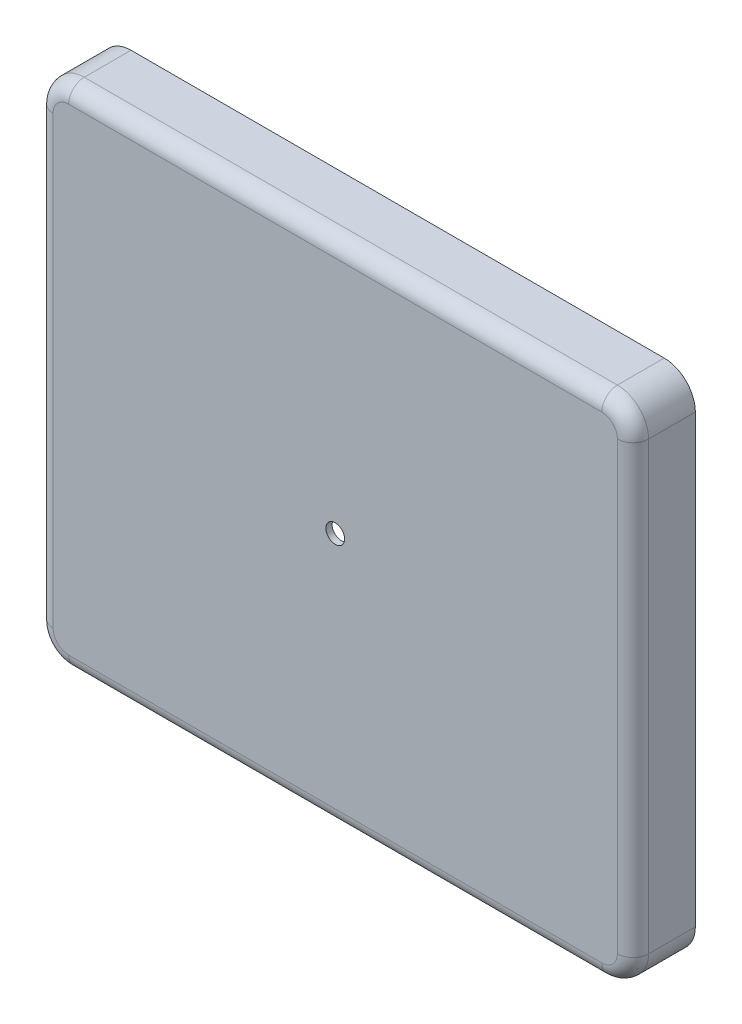
ISO-10303-21;
HEADER;
FILE_DESCRIPTION(('STEP AP214'),'2;1');
FILE_NAME('part.step','',(''),(''),'','','');
FILE_SCHEMA(('AUTOMOTIVE_DESIGN { 1 0 10303 214 1 1 1 1 }'));
ENDSEC;
DATA;
#1=APPLICATION_CONTEXT('core data for automotive mechanical design processes');
#2=APPLICATION_PROTOCOL_DEFINITION('international standard','automotive_design',2000,#1);
#3=PRODUCT_CONTEXT('',#1,'mechanical');
#4=PRODUCT('Part','Part','',(#3));
#5=PRODUCT_RELATED_PRODUCT_CATEGORY('part','',(#4));
#6=PRODUCT_DEFINITION_FORMATION('','',#4);
#7=PRODUCT_DEFINITION_CONTEXT('part definition',#1,'design');
#8=PRODUCT_DEFINITION('design','',#6,#7);
#9=PRODUCT_DEFINITION_SHAPE('','',#8);
#10=(LENGTH_UNIT() NAMED_UNIT(*) SI_UNIT(.MILLI.,.METRE.));
#11=(NAMED_UNIT(*) PLANE_ANGLE_UNIT() SI_UNIT($,.RADIAN.));
#12=(NAMED_UNIT(*) SI_UNIT($,.STERADIAN.) SOLID_ANGLE_UNIT());
#13=UNCERTAINTY_MEASURE_WITH_UNIT(LENGTH_MEASURE(1.E-05),#10,'distance_accuracy_value','');
#14=(GEOMETRIC_REPRESENTATION_CONTEXT(3) GLOBAL_UNCERTAINTY_ASSIGNED_CONTEXT((#13)) GLOBAL_UNIT_ASSIGNED_CONTEXT((#10,
#11,#12)) REPRESENTATION_CONTEXT('',''));
#15=CARTESIAN_POINT('',(0.,0.,0.));
#16=DIRECTION('',(0.,0.,1.));
#17=DIRECTION('',(1.,0.,0.));
#18=AXIS2_PLACEMENT_3D('',#15,#16,#17);
#19=CARTESIAN_POINT('',(0.,0.,0.));
#20=DIRECTION('',(0.,0.,1.));
#21=DIRECTION('',(1.,0.,0.));
#22=AXIS2_PLACEMENT_3D('',#19,#20,#21);
#23=PLANE('',#22);
#24=DIRECTION('',(1.,0.,0.));
#25=VECTOR('',#24,1.);
#26=CARTESIAN_POINT('',(-95.5,-81.5,0.));
#27=LINE('',#26,#25);
#28=CARTESIAN_POINT('',(-85.5,-81.5,0.));
#29=VERTEX_POINT('',#28);
#30=CARTESIAN_POINT('',(85.5,-81.5,0.));
#31=VERTEX_POINT('',#30);
#32=EDGE_CURVE('E336',#29,#31,#27,.T.);
#33=ORIENTED_EDGE('',*,*,#32,.F.);
#34=CARTESIAN_POINT('',(-85.5,-71.5,0.));
#35=DIRECTION('',(0.,0.,1.));
#36=DIRECTION('',(1.,0.,0.));
#37=AXIS2_PLACEMENT_3D('',#34,#35,#36);
#38=CIRCLE('',#37,10.);
#39=CARTESIAN_POINT('',(-95.5,-71.5,0.));
#40=VERTEX_POINT('',#39);
#41=EDGE_CURVE('E356',#29,#40,#38,.F.);
#42=ORIENTED_EDGE('',*,*,#41,.T.);
#43=DIRECTION('',(0.,-1.,0.));
#44=VECTOR('',#43,1.);
#45=CARTESIAN_POINT('',(-95.5,81.5,0.));
#46=LINE('',#45,#44);
#47=CARTESIAN_POINT('',(-95.5,71.5,0.));
#48=VERTEX_POINT('',#47);
#49=EDGE_CURVE('E332',#48,#40,#46,.T.);
#50=ORIENTED_EDGE('',*,*,#49,.F.);
#51=CARTESIAN_POINT('',(-85.5,71.5,0.));
#52=DIRECTION('',(0.,0.,1.));
#53=DIRECTION('',(1.,0.,0.));
#54=AXIS2_PLACEMENT_3D('',#51,#52,#53);
#55=CIRCLE('',#54,10.);
#56=CARTESIAN_POINT('',(-85.5,81.5,0.));
#57=VERTEX_POINT('',#56);
#58=EDGE_CURVE('E347',#48,#57,#55,.F.);
#59=ORIENTED_EDGE('',*,*,#58,.T.);
#60=DIRECTION('',(-1.,0.,0.));
#61=VECTOR('',#60,1.);
#62=CARTESIAN_POINT('',(-95.5,81.5,0.));
#63=LINE('',#62,#61);
#64=CARTESIAN_POINT('',(85.5,81.5,0.));
#65=VERTEX_POINT('',#64);
#66=EDGE_CURVE('E328',#65,#57,#63,.T.);
#67=ORIENTED_EDGE('',*,*,#66,.F.);
#68=CARTESIAN_POINT('',(85.5,71.5,0.));
#69=DIRECTION('',(0.,0.,1.));
#70=DIRECTION('',(1.,0.,0.));
#71=AXIS2_PLACEMENT_3D('',#68,#69,#70);
#72=CIRCLE('',#71,10.);
#73=CARTESIAN_POINT('',(95.5,71.5,0.));
#74=VERTEX_POINT('',#73);
#75=EDGE_CURVE('E350',#65,#74,#72,.F.);
#76=ORIENTED_EDGE('',*,*,#75,.T.);
#77=DIRECTION('',(0.,1.,0.));
#78=VECTOR('',#77,1.);
#79=CARTESIAN_POINT('',(95.5,81.5,0.));
#80=LINE('',#79,#78);
#81=CARTESIAN_POINT('',(95.5,-71.5,0.));
#82=VERTEX_POINT('',#81);
#83=EDGE_CURVE('E324',#82,#74,#80,.T.);
#84=ORIENTED_EDGE('',*,*,#83,.F.);
#85=CARTESIAN_POINT('',(85.5,-71.5,0.));
#86=DIRECTION('',(0.,0.,1.));
#87=DIRECTION('',(1.,0.,0.));
#88=AXIS2_PLACEMENT_3D('',#85,#86,#87);
#89=CIRCLE('',#88,10.);
#90=EDGE_CURVE('E353',#82,#31,#89,.F.);
#91=ORIENTED_EDGE('',*,*,#90,.T.);
#92=EDGE_LOOP('',(#33,#42,#50,#59,#67,#76,#84,#91));
#93=FACE_BOUND('',#92,.T.);
#94=CARTESIAN_POINT('',(-85.5,-71.5,0.));
#95=DIRECTION('',(0.,0.,1.));
#96=DIRECTION('',(1.,0.,0.));
#97=AXIS2_PLACEMENT_3D('',#94,#95,#96);
#98=CIRCLE('',#97,8.);
#99=CARTESIAN_POINT('',(-85.5,-79.5,0.));
#100=VERTEX_POINT('',#99);
#101=CARTESIAN_POINT('',(-93.5,-71.5,0.));
#102=VERTEX_POINT('',#101);
#103=EDGE_CURVE('E302',#100,#102,#98,.F.);
#104=ORIENTED_EDGE('',*,*,#103,.F.);
#105=DIRECTION('',(1.,0.,0.));
#106=VECTOR('',#105,1.);
#107=CARTESIAN_POINT('',(-95.5,-79.5,0.));
#108=LINE('',#107,#106);
#109=CARTESIAN_POINT('',(85.5,-79.5,0.));
#110=VERTEX_POINT('',#109);
#111=EDGE_CURVE('E304',#100,#110,#108,.T.);
#112=ORIENTED_EDGE('',*,*,#111,.T.);
#113=CARTESIAN_POINT('',(85.5,-71.5,0.));
#114=DIRECTION('',(0.,0.,1.));
#115=DIRECTION('',(1.,0.,0.));
#116=AXIS2_PLACEMENT_3D('',#113,#114,#115);
#117=CIRCLE('',#116,8.);
#118=CARTESIAN_POINT('',(93.5,-71.5,0.));
#119=VERTEX_POINT('',#118);
#120=EDGE_CURVE('E299',#119,#110,#117,.F.);
#121=ORIENTED_EDGE('',*,*,#120,.F.);
#122=DIRECTION('',(0.,1.,0.));
#123=VECTOR('',#122,1.);
#124=CARTESIAN_POINT('',(93.5,81.5,0.));
#125=LINE('',#124,#123);
#126=CARTESIAN_POINT('',(93.5,71.5,0.));
#127=VERTEX_POINT('',#126);
#128=EDGE_CURVE('E59',#119,#127,#125,.T.);
#129=ORIENTED_EDGE('',*,*,#128,.T.);
#130=CARTESIAN_POINT('',(85.5,71.5,0.));
#131=DIRECTION('',(0.,0.,1.));
#132=DIRECTION('',(1.,0.,0.));
#133=AXIS2_PLACEMENT_3D('',#130,#131,#132);
#134=CIRCLE('',#133,8.);
#135=CARTESIAN_POINT('',(85.5,79.5,0.));
#136=VERTEX_POINT('',#135);
#137=EDGE_CURVE('E303',#136,#127,#134,.F.);
#138=ORIENTED_EDGE('',*,*,#137,.F.);
#139=DIRECTION('',(-1.,0.,0.));
#140=VECTOR('',#139,1.);
#141=CARTESIAN_POINT('',(-95.5,79.5,0.));
#142=LINE('',#141,#140);
#143=CARTESIAN_POINT('',(-85.5,79.5,0.));
#144=VERTEX_POINT('',#143);
#145=EDGE_CURVE('E246',#136,#144,#142,.T.);
#146=ORIENTED_EDGE('',*,*,#145,.T.);
#147=CARTESIAN_POINT('',(-85.5,71.5,0.));
#148=DIRECTION('',(0.,0.,1.));
#149=DIRECTION('',(1.,0.,0.));
#150=AXIS2_PLACEMENT_3D('',#147,#148,#149);
#151=CIRCLE('',#150,8.);
#152=CARTESIAN_POINT('',(-93.5,71.5,0.));
#153=VERTEX_POINT('',#152);
#154=EDGE_CURVE('E315',#153,#144,#151,.F.);
#155=ORIENTED_EDGE('',*,*,#154,.F.);
#156=DIRECTION('',(0.,-1.,0.));
#157=VECTOR('',#156,1.);
#158=CARTESIAN_POINT('',(-93.5,81.5,0.));
#159=LINE('',#158,#157);
#160=EDGE_CURVE('E308',#153,#102,#159,.T.);
#161=ORIENTED_EDGE('',*,*,#160,.T.);
#162=EDGE_LOOP('',(#104,#112,#121,#129,#138,#146,#155,#161));
#163=FACE_BOUND('',#162,.T.);
#164=ADVANCED_FACE('F41',(#93,#163),#23,.F.);
#165=CARTESIAN_POINT('',(95.5,81.5,20.));
#166=DIRECTION('',(-1.,0.,0.));
#167=DIRECTION('',(0.,0.,1.));
#168=AXIS2_PLACEMENT_3D('',#165,#166,#167);
#169=PLANE('',#168);
#170=DIRECTION('',(0.,0.,-1.));
#171=VECTOR('',#170,1.);
#172=CARTESIAN_POINT('',(95.5,71.5,20.));
#173=LINE('',#172,#171);
#174=CARTESIAN_POINT('',(95.5,71.5,15.));
#175=VERTEX_POINT('',#174);
#176=EDGE_CURVE('E365',#74,#175,#173,.F.);
#177=ORIENTED_EDGE('',*,*,#176,.T.);
#178=DIRECTION('',(0.,1.,0.));
#179=VECTOR('',#178,1.);
#180=CARTESIAN_POINT('',(95.5,-71.5,15.));
#181=LINE('',#180,#179);
#182=CARTESIAN_POINT('',(95.5,-71.5,15.));
#183=VERTEX_POINT('',#182);
#184=EDGE_CURVE('E414',#175,#183,#181,.F.);
#185=ORIENTED_EDGE('',*,*,#184,.T.);
#186=DIRECTION('',(0.,0.,-1.));
#187=VECTOR('',#186,1.);
#188=CARTESIAN_POINT('',(95.5,-71.5,20.));
#189=LINE('',#188,#187);
#190=EDGE_CURVE('E369',#183,#82,#189,.T.);
#191=ORIENTED_EDGE('',*,*,#190,.T.);
#192=ORIENTED_EDGE('',*,*,#83,.T.);
#193=EDGE_LOOP('',(#177,#185,#191,#192));
#194=FACE_BOUND('',#193,.T.);
#195=ADVANCED_FACE('F482',(#194),#169,.F.);
#196=CARTESIAN_POINT('',(-95.5,81.5,20.));
#197=DIRECTION('',(0.,-1.,0.));
#198=DIRECTION('',(0.,0.,-1.));
#199=AXIS2_PLACEMENT_3D('',#196,#197,#198);
#200=PLANE('',#199);
#201=DIRECTION('',(0.,0.,-1.));
#202=VECTOR('',#201,1.);
#203=CARTESIAN_POINT('',(-85.5,81.5,20.));
#204=LINE('',#203,#202);
#205=CARTESIAN_POINT('',(-85.5,81.5,15.));
#206=VERTEX_POINT('',#205);
#207=EDGE_CURVE('E372',#57,#206,#204,.F.);
#208=ORIENTED_EDGE('',*,*,#207,.T.);
#209=DIRECTION('',(-1.,0.,0.));
#210=VECTOR('',#209,1.);
#211=CARTESIAN_POINT('',(85.5,81.5,15.));
#212=LINE('',#211,#210);
#213=CARTESIAN_POINT('',(85.5,81.5,15.));
#214=VERTEX_POINT('',#213);
#215=EDGE_CURVE('E408',#206,#214,#212,.F.);
#216=ORIENTED_EDGE('',*,*,#215,.T.);
#217=DIRECTION('',(0.,0.,-1.));
#218=VECTOR('',#217,1.);
#219=CARTESIAN_POINT('',(85.5,81.5,20.));
#220=LINE('',#219,#218);
#221=EDGE_CURVE('E376',#214,#65,#220,.T.);
#222=ORIENTED_EDGE('',*,*,#221,.T.);
#223=ORIENTED_EDGE('',*,*,#66,.T.);
#224=EDGE_LOOP('',(#208,#216,#222,#223));
#225=FACE_BOUND('',#224,.T.);
#226=ADVANCED_FACE('F535',(#225),#200,.F.);
#227=CARTESIAN_POINT('',(-95.5,81.5,20.));
#228=DIRECTION('',(1.,0.,0.));
#229=DIRECTION('',(0.,1.,0.));
#230=AXIS2_PLACEMENT_3D('',#227,#228,#229);
#231=PLANE('',#230);
#232=DIRECTION('',(0.,0.,-1.));
#233=VECTOR('',#232,1.);
#234=CARTESIAN_POINT('',(-95.5,-71.5,20.));
#235=LINE('',#234,#233);
#236=CARTESIAN_POINT('',(-95.5,-71.5,15.));
#237=VERTEX_POINT('',#236);
#238=EDGE_CURVE('E362',#40,#237,#235,.F.);
#239=ORIENTED_EDGE('',*,*,#238,.T.);
#240=DIRECTION('',(0.,-1.,0.));
#241=VECTOR('',#240,1.);
#242=CARTESIAN_POINT('',(-95.5,71.5,15.));
#243=LINE('',#242,#241);
#244=CARTESIAN_POINT('',(-95.5,71.5,15.));
#245=VERTEX_POINT('',#244);
#246=EDGE_CURVE('E11',#237,#245,#243,.F.);
#247=ORIENTED_EDGE('',*,*,#246,.T.);
#248=DIRECTION('',(0.,0.,-1.));
#249=VECTOR('',#248,1.);
#250=CARTESIAN_POINT('',(-95.5,71.5,20.));
#251=LINE('',#250,#249);
#252=EDGE_CURVE('E359',#245,#48,#251,.T.);
#253=ORIENTED_EDGE('',*,*,#252,.T.);
#254=ORIENTED_EDGE('',*,*,#49,.T.);
#255=EDGE_LOOP('',(#239,#247,#253,#254));
#256=FACE_BOUND('',#255,.T.);
#257=ADVANCED_FACE('F512',(#256),#231,.F.);
#258=CARTESIAN_POINT('',(-95.5,-81.5,20.));
#259=DIRECTION('',(0.,1.,0.));
#260=DIRECTION('',(0.,0.,1.));
#261=AXIS2_PLACEMENT_3D('',#258,#259,#260);
#262=PLANE('',#261);
#263=DIRECTION('',(0.,0.,-1.));
#264=VECTOR('',#263,1.);
#265=CARTESIAN_POINT('',(85.5,-81.5,20.));
#266=LINE('',#265,#264);
#267=CARTESIAN_POINT('',(85.5,-81.5,15.));
#268=VERTEX_POINT('',#267);
#269=EDGE_CURVE('E340',#31,#268,#266,.F.);
#270=ORIENTED_EDGE('',*,*,#269,.T.);
#271=DIRECTION('',(1.,0.,0.));
#272=VECTOR('',#271,1.);
#273=CARTESIAN_POINT('',(-85.5,-81.5,15.));
#274=LINE('',#273,#272);
#275=CARTESIAN_POINT('',(-85.5,-81.5,15.));
#276=VERTEX_POINT('',#275);
#277=EDGE_CURVE('E420',#268,#276,#274,.F.);
#278=ORIENTED_EDGE('',*,*,#277,.T.);
#279=DIRECTION('',(0.,0.,-1.));
#280=VECTOR('',#279,1.);
#281=CARTESIAN_POINT('',(-85.5,-81.5,20.));
#282=LINE('',#281,#280);
#283=EDGE_CURVE('E344',#276,#29,#282,.T.);
#284=ORIENTED_EDGE('',*,*,#283,.T.);
#285=ORIENTED_EDGE('',*,*,#32,.T.);
#286=EDGE_LOOP('',(#270,#278,#284,#285));
#287=FACE_BOUND('',#286,.T.);
#288=ADVANCED_FACE('F471',(#287),#262,.F.);
#289=CARTESIAN_POINT('',(0.,0.,20.));
#290=DIRECTION('',(0.,0.,1.));
#291=DIRECTION('',(1.,0.,0.));
#292=AXIS2_PLACEMENT_3D('',#289,#290,#291);
#293=PLANE('',#292);
#294=CARTESIAN_POINT('',(0.,0.,20.));
#295=DIRECTION('',(0.,0.,1.));
#296=DIRECTION('',(1.,0.,0.));
#297=AXIS2_PLACEMENT_3D('',#294,#295,#296);
#298=CIRCLE('',#297,3.);
#299=CARTESIAN_POINT('',(3.,0.,20.));
#300=VERTEX_POINT('',#299);
#301=EDGE_CURVE('E293',#300,#300,#298,.T.);
#302=ORIENTED_EDGE('',*,*,#301,.F.);
#303=EDGE_LOOP('',(#302));
#304=FACE_BOUND('',#303,.T.);
#305=DIRECTION('',(-1.,0.,0.));
#306=VECTOR('',#305,1.);
#307=CARTESIAN_POINT('',(-85.5,76.5,20.));
#308=LINE('',#307,#306);
#309=CARTESIAN_POINT('',(85.5,76.5,20.));
#310=VERTEX_POINT('',#309);
#311=CARTESIAN_POINT('',(-85.5,76.5,20.));
#312=VERTEX_POINT('',#311);
#313=EDGE_CURVE('E397',#310,#312,#308,.T.);
#314=ORIENTED_EDGE('',*,*,#313,.T.);
#315=CARTESIAN_POINT('',(-85.5,71.5,20.));
#316=DIRECTION('',(0.,0.,1.));
#317=DIRECTION('',(1.,0.,0.));
#318=AXIS2_PLACEMENT_3D('',#315,#316,#317);
#319=CIRCLE('',#318,5.);
#320=CARTESIAN_POINT('',(-90.5,71.5,20.));
#321=VERTEX_POINT('',#320);
#322=EDGE_CURVE('E400',#312,#321,#319,.T.);
#323=ORIENTED_EDGE('',*,*,#322,.T.);
#324=DIRECTION('',(0.,-1.,0.));
#325=VECTOR('',#324,1.);
#326=CARTESIAN_POINT('',(-90.5,-71.5,20.));
#327=LINE('',#326,#325);
#328=CARTESIAN_POINT('',(-90.5,-71.5,20.));
#329=VERTEX_POINT('',#328);
#330=EDGE_CURVE('E379',#321,#329,#327,.T.);
#331=ORIENTED_EDGE('',*,*,#330,.T.);
#332=CARTESIAN_POINT('',(-85.5,-71.5,20.));
#333=DIRECTION('',(0.,0.,1.));
#334=DIRECTION('',(1.,0.,0.));
#335=AXIS2_PLACEMENT_3D('',#332,#333,#334);
#336=CIRCLE('',#335,5.);
#337=CARTESIAN_POINT('',(-85.5,-76.5,20.));
#338=VERTEX_POINT('',#337);
#339=EDGE_CURVE('E382',#329,#338,#336,.T.);
#340=ORIENTED_EDGE('',*,*,#339,.T.);
#341=DIRECTION('',(1.,0.,0.));
#342=VECTOR('',#341,1.);
#343=CARTESIAN_POINT('',(85.5,-76.5,20.));
#344=LINE('',#343,#342);
#345=CARTESIAN_POINT('',(85.5,-76.5,20.));
#346=VERTEX_POINT('',#345);
#347=EDGE_CURVE('E385',#338,#346,#344,.T.);
#348=ORIENTED_EDGE('',*,*,#347,.T.);
#349=CARTESIAN_POINT('',(85.5,-71.5,20.));
#350=DIRECTION('',(0.,0.,1.));
#351=DIRECTION('',(1.,0.,0.));
#352=AXIS2_PLACEMENT_3D('',#349,#350,#351);
#353=CIRCLE('',#352,5.);
#354=CARTESIAN_POINT('',(90.5,-71.5,20.));
#355=VERTEX_POINT('',#354);
#356=EDGE_CURVE('E388',#346,#355,#353,.T.);
#357=ORIENTED_EDGE('',*,*,#356,.T.);
#358=DIRECTION('',(0.,1.,0.));
#359=VECTOR('',#358,1.);
#360=CARTESIAN_POINT('',(90.5,71.5,20.));
#361=LINE('',#360,#359);
#362=CARTESIAN_POINT('',(90.5,71.5,20.));
#363=VERTEX_POINT('',#362);
#364=EDGE_CURVE('E391',#355,#363,#361,.T.);
#365=ORIENTED_EDGE('',*,*,#364,.T.);
#366=CARTESIAN_POINT('',(85.5,71.5,20.));
#367=DIRECTION('',(0.,0.,1.));
#368=DIRECTION('',(1.,0.,0.));
#369=AXIS2_PLACEMENT_3D('',#366,#367,#368);
#370=CIRCLE('',#369,5.);
#371=EDGE_CURVE('E394',#363,#310,#370,.T.);
#372=ORIENTED_EDGE('',*,*,#371,.T.);
#373=EDGE_LOOP('',(#314,#323,#331,#340,#348,#357,#365,#372));
#374=FACE_BOUND('',#373,.T.);
#375=ADVANCED_FACE('F498',(#304,#374),#293,.T.);
#376=CARTESIAN_POINT('',(-85.5,-71.5,20.));
#377=DIRECTION('',(0.,0.,-1.));
#378=DIRECTION('',(-1.,0.,0.));
#379=AXIS2_PLACEMENT_3D('',#376,#377,#378);
#380=CYLINDRICAL_SURFACE('',#379,10.);
#381=ORIENTED_EDGE('',*,*,#283,.F.);
#382=CARTESIAN_POINT('',(-85.5,-71.5,15.));
#383=DIRECTION('',(0.,0.,1.));
#384=DIRECTION('',(1.,0.,0.));
#385=AXIS2_PLACEMENT_3D('',#382,#383,#384);
#386=CIRCLE('',#385,10.);
#387=EDGE_CURVE('E51',#276,#237,#386,.F.);
#388=ORIENTED_EDGE('',*,*,#387,.T.);
#389=ORIENTED_EDGE('',*,*,#238,.F.);
#390=ORIENTED_EDGE('',*,*,#41,.F.);
#391=EDGE_LOOP('',(#381,#388,#389,#390));
#392=FACE_BOUND('',#391,.T.);
#393=ADVANCED_FACE('F547',(#392),#380,.T.);
#394=CARTESIAN_POINT('',(85.5,-71.5,20.));
#395=DIRECTION('',(0.,0.,-1.));
#396=DIRECTION('',(-1.,0.,0.));
#397=AXIS2_PLACEMENT_3D('',#394,#395,#396);
#398=CYLINDRICAL_SURFACE('',#397,10.);
#399=ORIENTED_EDGE('',*,*,#190,.F.);
#400=CARTESIAN_POINT('',(85.5,-71.5,15.));
#401=DIRECTION('',(0.,0.,1.));
#402=DIRECTION('',(1.,0.,0.));
#403=AXIS2_PLACEMENT_3D('',#400,#401,#402);
#404=CIRCLE('',#403,10.);
#405=EDGE_CURVE('E417',#183,#268,#404,.F.);
#406=ORIENTED_EDGE('',*,*,#405,.T.);
#407=ORIENTED_EDGE('',*,*,#269,.F.);
#408=ORIENTED_EDGE('',*,*,#90,.F.);
#409=EDGE_LOOP('',(#399,#406,#407,#408));
#410=FACE_BOUND('',#409,.T.);
#411=ADVANCED_FACE('F468',(#410),#398,.T.);
#412=CARTESIAN_POINT('',(85.5,71.5,20.));
#413=DIRECTION('',(0.,0.,-1.));
#414=DIRECTION('',(-1.,0.,0.));
#415=AXIS2_PLACEMENT_3D('',#412,#413,#414);
#416=CYLINDRICAL_SURFACE('',#415,10.);
#417=ORIENTED_EDGE('',*,*,#221,.F.);
#418=CARTESIAN_POINT('',(85.5,71.5,15.));
#419=DIRECTION('',(0.,0.,1.));
#420=DIRECTION('',(1.,0.,0.));
#421=AXIS2_PLACEMENT_3D('',#418,#419,#420);
#422=CIRCLE('',#421,10.);
#423=EDGE_CURVE('E411',#214,#175,#422,.F.);
#424=ORIENTED_EDGE('',*,*,#423,.T.);
#425=ORIENTED_EDGE('',*,*,#176,.F.);
#426=ORIENTED_EDGE('',*,*,#75,.F.);
#427=EDGE_LOOP('',(#417,#424,#425,#426));
#428=FACE_BOUND('',#427,.T.);
#429=ADVANCED_FACE('F485',(#428),#416,.T.);
#430=CARTESIAN_POINT('',(-85.5,71.5,20.));
#431=DIRECTION('',(0.,0.,-1.));
#432=DIRECTION('',(-1.,0.,0.));
#433=AXIS2_PLACEMENT_3D('',#430,#431,#432);
#434=CYLINDRICAL_SURFACE('',#433,10.);
#435=ORIENTED_EDGE('',*,*,#252,.F.);
#436=CARTESIAN_POINT('',(-85.5,71.5,15.));
#437=DIRECTION('',(0.,0.,1.));
#438=DIRECTION('',(1.,0.,0.));
#439=AXIS2_PLACEMENT_3D('',#436,#437,#438);
#440=CIRCLE('',#439,10.);
#441=EDGE_CURVE('E404',#245,#206,#440,.F.);
#442=ORIENTED_EDGE('',*,*,#441,.T.);
#443=ORIENTED_EDGE('',*,*,#207,.F.);
#444=ORIENTED_EDGE('',*,*,#58,.F.);
#445=EDGE_LOOP('',(#435,#442,#443,#444));
#446=FACE_BOUND('',#445,.T.);
#447=ADVANCED_FACE('F516',(#446),#434,.T.);
#448=CARTESIAN_POINT('',(85.5,-71.5,15.));
#449=DIRECTION('',(0.,0.,1.));
#450=DIRECTION('',(1.,0.,0.));
#451=AXIS2_PLACEMENT_3D('',#448,#449,#450);
#452=DEGENERATE_TOROIDAL_SURFACE('',#451,5.,5.,.T.);
#453=CARTESIAN_POINT('',(85.5,-76.5,15.));
#454=DIRECTION('',(-1.,0.,0.));
#455=DIRECTION('',(0.,-1.,0.));
#456=AXIS2_PLACEMENT_3D('',#453,#454,#455);
#457=CIRCLE('',#456,5.);
#458=EDGE_CURVE('E447',#268,#346,#457,.T.);
#459=ORIENTED_EDGE('',*,*,#458,.F.);
#460=ORIENTED_EDGE('',*,*,#405,.F.);
#461=CARTESIAN_POINT('',(90.5,-71.5,15.));
#462=DIRECTION('',(0.,1.,0.));
#463=DIRECTION('',(0.,0.,1.));
#464=AXIS2_PLACEMENT_3D('',#461,#462,#463);
#465=CIRCLE('',#464,5.);
#466=EDGE_CURVE('E45',#355,#183,#465,.T.);
#467=ORIENTED_EDGE('',*,*,#466,.F.);
#468=ORIENTED_EDGE('',*,*,#356,.F.);
#469=EDGE_LOOP('',(#459,#460,#467,#468));
#470=FACE_BOUND('',#469,.T.);
#471=ADVANCED_FACE('F43',(#470),#452,.T.);
#472=CARTESIAN_POINT('',(90.5,0.,15.));
#473=DIRECTION('',(0.,-1.,0.));
#474=DIRECTION('',(0.,0.,-1.));
#475=AXIS2_PLACEMENT_3D('',#472,#473,#474);
#476=CYLINDRICAL_SURFACE('',#475,5.);
#477=ORIENTED_EDGE('',*,*,#466,.T.);
#478=ORIENTED_EDGE('',*,*,#184,.F.);
#479=CARTESIAN_POINT('',(90.5,71.5,15.));
#480=DIRECTION('',(0.,1.,0.));
#481=DIRECTION('',(0.,0.,1.));
#482=AXIS2_PLACEMENT_3D('',#479,#480,#481);
#483=CIRCLE('',#482,5.);
#484=EDGE_CURVE('E444',#363,#175,#483,.T.);
#485=ORIENTED_EDGE('',*,*,#484,.F.);
#486=ORIENTED_EDGE('',*,*,#364,.F.);
#487=EDGE_LOOP('',(#477,#478,#485,#486));
#488=FACE_BOUND('',#487,.T.);
#489=ADVANCED_FACE('F460',(#488),#476,.T.);
#490=CARTESIAN_POINT('',(0.,-76.5,15.));
#491=DIRECTION('',(-1.,0.,0.));
#492=DIRECTION('',(0.,0.,1.));
#493=AXIS2_PLACEMENT_3D('',#490,#491,#492);
#494=CYLINDRICAL_SURFACE('',#493,5.);
#495=ORIENTED_EDGE('',*,*,#458,.T.);
#496=ORIENTED_EDGE('',*,*,#347,.F.);
#497=CARTESIAN_POINT('',(-85.5,-76.5,15.));
#498=DIRECTION('',(-1.,0.,0.));
#499=DIRECTION('',(0.,0.,1.));
#500=AXIS2_PLACEMENT_3D('',#497,#498,#499);
#501=CIRCLE('',#500,5.);
#502=EDGE_CURVE('E440',#276,#338,#501,.T.);
#503=ORIENTED_EDGE('',*,*,#502,.F.);
#504=ORIENTED_EDGE('',*,*,#277,.F.);
#505=EDGE_LOOP('',(#495,#496,#503,#504));
#506=FACE_BOUND('',#505,.T.);
#507=ADVANCED_FACE('F501',(#506),#494,.T.);
#508=CARTESIAN_POINT('',(85.5,71.5,15.));
#509=DIRECTION('',(0.,0.,1.));
#510=DIRECTION('',(1.,0.,0.));
#511=AXIS2_PLACEMENT_3D('',#508,#509,#510);
#512=DEGENERATE_TOROIDAL_SURFACE('',#511,5.,5.,.T.);
#513=ORIENTED_EDGE('',*,*,#484,.T.);
#514=ORIENTED_EDGE('',*,*,#423,.F.);
#515=CARTESIAN_POINT('',(85.5,76.5,15.));
#516=DIRECTION('',(-1.,0.,0.));
#517=DIRECTION('',(0.,0.,1.));
#518=AXIS2_PLACEMENT_3D('',#515,#516,#517);
#519=CIRCLE('',#518,5.);
#520=EDGE_CURVE('E436',#310,#214,#519,.T.);
#521=ORIENTED_EDGE('',*,*,#520,.F.);
#522=ORIENTED_EDGE('',*,*,#371,.F.);
#523=EDGE_LOOP('',(#513,#514,#521,#522));
#524=FACE_BOUND('',#523,.T.);
#525=ADVANCED_FACE('F489',(#524),#512,.T.);
#526=CARTESIAN_POINT('',(-85.5,-71.5,15.));
#527=DIRECTION('',(0.,0.,1.));
#528=DIRECTION('',(1.,0.,0.));
#529=AXIS2_PLACEMENT_3D('',#526,#527,#528);
#530=DEGENERATE_TOROIDAL_SURFACE('',#529,5.,5.,.T.);
#531=ORIENTED_EDGE('',*,*,#502,.T.);
#532=ORIENTED_EDGE('',*,*,#339,.F.);
#533=CARTESIAN_POINT('',(-90.5,-71.5,15.));
#534=DIRECTION('',(0.,1.,0.));
#535=DIRECTION('',(-1.,0.,0.));
#536=AXIS2_PLACEMENT_3D('',#533,#534,#535);
#537=CIRCLE('',#536,5.);
#538=EDGE_CURVE('E432',#237,#329,#537,.T.);
#539=ORIENTED_EDGE('',*,*,#538,.F.);
#540=ORIENTED_EDGE('',*,*,#387,.F.);
#541=EDGE_LOOP('',(#531,#532,#539,#540));
#542=FACE_BOUND('',#541,.T.);
#543=ADVANCED_FACE('F503',(#542),#530,.T.);
#544=CARTESIAN_POINT('',(0.,76.5,15.));
#545=DIRECTION('',(1.,0.,0.));
#546=DIRECTION('',(0.,0.,-1.));
#547=AXIS2_PLACEMENT_3D('',#544,#545,#546);
#548=CYLINDRICAL_SURFACE('',#547,5.);
#549=ORIENTED_EDGE('',*,*,#520,.T.);
#550=ORIENTED_EDGE('',*,*,#215,.F.);
#551=CARTESIAN_POINT('',(-85.5,76.5,15.));
#552=DIRECTION('',(-1.,0.,0.));
#553=DIRECTION('',(0.,0.,1.));
#554=AXIS2_PLACEMENT_3D('',#551,#552,#553);
#555=CIRCLE('',#554,5.);
#556=EDGE_CURVE('E428',#312,#206,#555,.T.);
#557=ORIENTED_EDGE('',*,*,#556,.F.);
#558=ORIENTED_EDGE('',*,*,#313,.F.);
#559=EDGE_LOOP('',(#549,#550,#557,#558));
#560=FACE_BOUND('',#559,.T.);
#561=ADVANCED_FACE('F494',(#560),#548,.T.);
#562=CARTESIAN_POINT('',(-90.5,0.,15.));
#563=DIRECTION('',(0.,1.,0.));
#564=DIRECTION('',(-1.,0.,0.));
#565=AXIS2_PLACEMENT_3D('',#562,#563,#564);
#566=CYLINDRICAL_SURFACE('',#565,5.);
#567=ORIENTED_EDGE('',*,*,#538,.T.);
#568=ORIENTED_EDGE('',*,*,#330,.F.);
#569=CARTESIAN_POINT('',(-90.5,71.5,15.));
#570=DIRECTION('',(0.,1.,0.));
#571=DIRECTION('',(0.,0.,1.));
#572=AXIS2_PLACEMENT_3D('',#569,#570,#571);
#573=CIRCLE('',#572,5.);
#574=EDGE_CURVE('E425',#245,#321,#573,.T.);
#575=ORIENTED_EDGE('',*,*,#574,.F.);
#576=ORIENTED_EDGE('',*,*,#246,.F.);
#577=EDGE_LOOP('',(#567,#568,#575,#576));
#578=FACE_BOUND('',#577,.T.);
#579=ADVANCED_FACE('F509',(#578),#566,.T.);
#580=CARTESIAN_POINT('',(-85.5,71.5,15.));
#581=DIRECTION('',(0.,0.,1.));
#582=DIRECTION('',(1.,0.,0.));
#583=AXIS2_PLACEMENT_3D('',#580,#581,#582);
#584=DEGENERATE_TOROIDAL_SURFACE('',#583,5.,5.,.T.);
#585=ORIENTED_EDGE('',*,*,#556,.T.);
#586=ORIENTED_EDGE('',*,*,#441,.F.);
#587=ORIENTED_EDGE('',*,*,#574,.T.);
#588=ORIENTED_EDGE('',*,*,#322,.F.);
#589=EDGE_LOOP('',(#585,#586,#587,#588));
#590=FACE_BOUND('',#589,.T.);
#591=ADVANCED_FACE('F519',(#590),#584,.T.);
#592=CARTESIAN_POINT('',(93.5,81.5,20.));
#593=DIRECTION('',(-1.,0.,0.));
#594=DIRECTION('',(0.,0.,1.));
#595=AXIS2_PLACEMENT_3D('',#592,#593,#594);
#596=PLANE('',#595);
#597=DIRECTION('',(0.,0.,1.));
#598=VECTOR('',#597,1.);
#599=CARTESIAN_POINT('',(93.5,71.5,20.));
#600=LINE('',#599,#598);
#601=CARTESIAN_POINT('',(93.5,71.5,15.));
#602=VERTEX_POINT('',#601);
#603=EDGE_CURVE('E226',#127,#602,#600,.T.);
#604=ORIENTED_EDGE('',*,*,#603,.F.);
#605=ORIENTED_EDGE('',*,*,#128,.F.);
#606=DIRECTION('',(0.,0.,1.));
#607=VECTOR('',#606,1.);
#608=CARTESIAN_POINT('',(93.5,-71.5,20.));
#609=LINE('',#608,#607);
#610=CARTESIAN_POINT('',(93.5,-71.5,15.));
#611=VERTEX_POINT('',#610);
#612=EDGE_CURVE('E219',#611,#119,#609,.F.);
#613=ORIENTED_EDGE('',*,*,#612,.F.);
#614=DIRECTION('',(0.,1.,0.));
#615=VECTOR('',#614,1.);
#616=CARTESIAN_POINT('',(93.5,81.5,15.));
#617=LINE('',#616,#615);
#618=EDGE_CURVE('E208',#602,#611,#617,.F.);
#619=ORIENTED_EDGE('',*,*,#618,.F.);
#620=EDGE_LOOP('',(#604,#605,#613,#619));
#621=FACE_BOUND('',#620,.T.);
#622=ADVANCED_FACE('F221',(#621),#596,.T.);
#623=CARTESIAN_POINT('',(-95.5,79.5,20.));
#624=DIRECTION('',(0.,-1.,0.));
#625=DIRECTION('',(0.,0.,-1.));
#626=AXIS2_PLACEMENT_3D('',#623,#624,#625);
#627=PLANE('',#626);
#628=DIRECTION('',(0.,0.,-1.));
#629=VECTOR('',#628,1.);
#630=CARTESIAN_POINT('',(-85.5,79.5,20.));
#631=LINE('',#630,#629);
#632=CARTESIAN_POINT('',(-85.5,79.5,15.));
#633=VERTEX_POINT('',#632);
#634=EDGE_CURVE('E225',#144,#633,#631,.F.);
#635=ORIENTED_EDGE('',*,*,#634,.F.);
#636=ORIENTED_EDGE('',*,*,#145,.F.);
#637=DIRECTION('',(0.,0.,-1.));
#638=VECTOR('',#637,1.);
#639=CARTESIAN_POINT('',(85.5,79.5,20.));
#640=LINE('',#639,#638);
#641=CARTESIAN_POINT('',(85.5,79.5,15.));
#642=VERTEX_POINT('',#641);
#643=EDGE_CURVE('E271',#642,#136,#640,.T.);
#644=ORIENTED_EDGE('',*,*,#643,.F.);
#645=DIRECTION('',(1.,0.,0.));
#646=VECTOR('',#645,1.);
#647=CARTESIAN_POINT('',(-95.5,79.5,15.));
#648=LINE('',#647,#646);
#649=EDGE_CURVE('E807',#633,#642,#648,.T.);
#650=ORIENTED_EDGE('',*,*,#649,.F.);
#651=EDGE_LOOP('',(#635,#636,#644,#650));
#652=FACE_BOUND('',#651,.T.);
#653=ADVANCED_FACE('F526',(#652),#627,.T.);
#654=CARTESIAN_POINT('',(-93.5,81.5,20.));
#655=DIRECTION('',(1.,0.,0.));
#656=DIRECTION('',(0.,1.,0.));
#657=AXIS2_PLACEMENT_3D('',#654,#655,#656);
#658=PLANE('',#657);
#659=DIRECTION('',(0.,0.,1.));
#660=VECTOR('',#659,1.);
#661=CARTESIAN_POINT('',(-93.5,-71.5,20.));
#662=LINE('',#661,#660);
#663=CARTESIAN_POINT('',(-93.5,-71.5,15.));
#664=VERTEX_POINT('',#663);
#665=EDGE_CURVE('E786',#102,#664,#662,.T.);
#666=ORIENTED_EDGE('',*,*,#665,.F.);
#667=ORIENTED_EDGE('',*,*,#160,.F.);
#668=DIRECTION('',(0.,0.,1.));
#669=VECTOR('',#668,1.);
#670=CARTESIAN_POINT('',(-93.5,71.5,20.));
#671=LINE('',#670,#669);
#672=CARTESIAN_POINT('',(-93.5,71.5,15.));
#673=VERTEX_POINT('',#672);
#674=EDGE_CURVE('E311',#673,#153,#671,.F.);
#675=ORIENTED_EDGE('',*,*,#674,.F.);
#676=DIRECTION('',(0.,1.,0.));
#677=VECTOR('',#676,1.);
#678=CARTESIAN_POINT('',(-93.5,81.5,15.));
#679=LINE('',#678,#677);
#680=EDGE_CURVE('E429',#664,#673,#679,.T.);
#681=ORIENTED_EDGE('',*,*,#680,.F.);
#682=EDGE_LOOP('',(#666,#667,#675,#681));
#683=FACE_BOUND('',#682,.T.);
#684=ADVANCED_FACE('F602',(#683),#658,.T.);
#685=CARTESIAN_POINT('',(-95.5,-79.5,20.));
#686=DIRECTION('',(0.,1.,0.));
#687=DIRECTION('',(0.,0.,1.));
#688=AXIS2_PLACEMENT_3D('',#685,#686,#687);
#689=PLANE('',#688);
#690=DIRECTION('',(0.,0.,1.));
#691=VECTOR('',#690,1.);
#692=CARTESIAN_POINT('',(85.5,-79.5,20.));
#693=LINE('',#692,#691);
#694=CARTESIAN_POINT('',(85.5,-79.5,15.));
#695=VERTEX_POINT('',#694);
#696=EDGE_CURVE('E231',#110,#695,#693,.T.);
#697=ORIENTED_EDGE('',*,*,#696,.F.);
#698=ORIENTED_EDGE('',*,*,#111,.F.);
#699=DIRECTION('',(0.,0.,1.));
#700=VECTOR('',#699,1.);
#701=CARTESIAN_POINT('',(-85.5,-79.5,20.));
#702=LINE('',#701,#700);
#703=CARTESIAN_POINT('',(-85.5,-79.5,15.));
#704=VERTEX_POINT('',#703);
#705=EDGE_CURVE('E318',#704,#100,#702,.F.);
#706=ORIENTED_EDGE('',*,*,#705,.F.);
#707=DIRECTION('',(1.,0.,0.));
#708=VECTOR('',#707,1.);
#709=CARTESIAN_POINT('',(-95.5,-79.5,15.));
#710=LINE('',#709,#708);
#711=EDGE_CURVE('E236',#695,#704,#710,.F.);
#712=ORIENTED_EDGE('',*,*,#711,.F.);
#713=EDGE_LOOP('',(#697,#698,#706,#712));
#714=FACE_BOUND('',#713,.T.);
#715=ADVANCED_FACE('F612',(#714),#689,.T.);
#716=CARTESIAN_POINT('',(0.,0.,18.));
#717=DIRECTION('',(0.,0.,1.));
#718=DIRECTION('',(1.,0.,0.));
#719=AXIS2_PLACEMENT_3D('',#716,#717,#718);
#720=PLANE('',#719);
#721=CARTESIAN_POINT('',(0.,0.,18.));
#722=DIRECTION('',(0.,0.,-1.));
#723=DIRECTION('',(-1.,0.,0.));
#724=AXIS2_PLACEMENT_3D('',#721,#722,#723);
#725=CIRCLE('',#724,3.);
#726=CARTESIAN_POINT('',(-3.,0.,18.));
#727=VERTEX_POINT('',#726);
#728=EDGE_CURVE('E778',#727,#727,#725,.T.);
#729=ORIENTED_EDGE('',*,*,#728,.F.);
#730=EDGE_LOOP('',(#729));
#731=FACE_BOUND('',#730,.T.);
#732=DIRECTION('',(1.,0.,0.));
#733=VECTOR('',#732,1.);
#734=CARTESIAN_POINT('',(0.,76.5,18.));
#735=LINE('',#734,#733);
#736=CARTESIAN_POINT('',(85.5,76.5,18.));
#737=VERTEX_POINT('',#736);
#738=CARTESIAN_POINT('',(-85.5,76.5,18.));
#739=VERTEX_POINT('',#738);
#740=EDGE_CURVE('E259',#737,#739,#735,.F.);
#741=ORIENTED_EDGE('',*,*,#740,.F.);
#742=CARTESIAN_POINT('',(85.5,71.5,18.));
#743=DIRECTION('',(0.,0.,1.));
#744=DIRECTION('',(1.,0.,0.));
#745=AXIS2_PLACEMENT_3D('',#742,#743,#744);
#746=CIRCLE('',#745,5.);
#747=CARTESIAN_POINT('',(90.5,71.5,18.));
#748=VERTEX_POINT('',#747);
#749=EDGE_CURVE('E258',#748,#737,#746,.T.);
#750=ORIENTED_EDGE('',*,*,#749,.F.);
#751=DIRECTION('',(0.,1.,0.));
#752=VECTOR('',#751,1.);
#753=CARTESIAN_POINT('',(90.5,0.,18.));
#754=LINE('',#753,#752);
#755=CARTESIAN_POINT('',(90.5,-71.5,18.));
#756=VERTEX_POINT('',#755);
#757=EDGE_CURVE('E255',#756,#748,#754,.T.);
#758=ORIENTED_EDGE('',*,*,#757,.F.);
#759=CARTESIAN_POINT('',(85.5,-71.5,18.));
#760=DIRECTION('',(0.,0.,1.));
#761=DIRECTION('',(1.,0.,0.));
#762=AXIS2_PLACEMENT_3D('',#759,#760,#761);
#763=CIRCLE('',#762,5.);
#764=CARTESIAN_POINT('',(85.5,-76.5,18.));
#765=VERTEX_POINT('',#764);
#766=EDGE_CURVE('E240',#765,#756,#763,.T.);
#767=ORIENTED_EDGE('',*,*,#766,.F.);
#768=DIRECTION('',(1.,0.,0.));
#769=VECTOR('',#768,1.);
#770=CARTESIAN_POINT('',(0.,-76.5,18.));
#771=LINE('',#770,#769);
#772=CARTESIAN_POINT('',(-85.5,-76.5,18.));
#773=VERTEX_POINT('',#772);
#774=EDGE_CURVE('E274',#773,#765,#771,.T.);
#775=ORIENTED_EDGE('',*,*,#774,.F.);
#776=CARTESIAN_POINT('',(-85.5,-71.5,18.));
#777=DIRECTION('',(0.,0.,1.));
#778=DIRECTION('',(1.,0.,0.));
#779=AXIS2_PLACEMENT_3D('',#776,#777,#778);
#780=CIRCLE('',#779,5.);
#781=CARTESIAN_POINT('',(-90.5,-71.5,18.));
#782=VERTEX_POINT('',#781);
#783=EDGE_CURVE('E270',#782,#773,#780,.T.);
#784=ORIENTED_EDGE('',*,*,#783,.F.);
#785=DIRECTION('',(0.,1.,0.));
#786=VECTOR('',#785,1.);
#787=CARTESIAN_POINT('',(-90.5,0.,18.));
#788=LINE('',#787,#786);
#789=CARTESIAN_POINT('',(-90.5,71.5,18.));
#790=VERTEX_POINT('',#789);
#791=EDGE_CURVE('E267',#790,#782,#788,.F.);
#792=ORIENTED_EDGE('',*,*,#791,.F.);
#793=CARTESIAN_POINT('',(-85.5,71.5,18.));
#794=DIRECTION('',(0.,0.,1.));
#795=DIRECTION('',(1.,0.,0.));
#796=AXIS2_PLACEMENT_3D('',#793,#794,#795);
#797=CIRCLE('',#796,5.);
#798=EDGE_CURVE('E262',#739,#790,#797,.T.);
#799=ORIENTED_EDGE('',*,*,#798,.F.);
#800=EDGE_LOOP('',(#741,#750,#758,#767,#775,#784,#792,#799));
#801=FACE_BOUND('',#800,.T.);
#802=ADVANCED_FACE('F622',(#731,#801),#720,.F.);
#803=CARTESIAN_POINT('',(-85.5,-71.5,20.));
#804=DIRECTION('',(0.,0.,-1.));
#805=DIRECTION('',(-1.,0.,0.));
#806=AXIS2_PLACEMENT_3D('',#803,#804,#805);
#807=CYLINDRICAL_SURFACE('',#806,8.);
#808=ORIENTED_EDGE('',*,*,#705,.T.);
#809=ORIENTED_EDGE('',*,*,#103,.T.);
#810=ORIENTED_EDGE('',*,*,#665,.T.);
#811=CARTESIAN_POINT('',(-85.5,-71.5,15.));
#812=DIRECTION('',(0.,0.,-1.));
#813=DIRECTION('',(-1.,0.,0.));
#814=AXIS2_PLACEMENT_3D('',#811,#812,#813);
#815=CIRCLE('',#814,8.);
#816=EDGE_CURVE('E792',#704,#664,#815,.T.);
#817=ORIENTED_EDGE('',*,*,#816,.F.);
#818=EDGE_LOOP('',(#808,#809,#810,#817));
#819=FACE_BOUND('',#818,.T.);
#820=ADVANCED_FACE('F630',(#819),#807,.F.);
#821=CARTESIAN_POINT('',(85.5,-71.5,20.));
#822=DIRECTION('',(0.,0.,-1.));
#823=DIRECTION('',(-1.,0.,0.));
#824=AXIS2_PLACEMENT_3D('',#821,#822,#823);
#825=CYLINDRICAL_SURFACE('',#824,8.);
#826=ORIENTED_EDGE('',*,*,#612,.T.);
#827=ORIENTED_EDGE('',*,*,#120,.T.);
#828=ORIENTED_EDGE('',*,*,#696,.T.);
#829=CARTESIAN_POINT('',(85.5,-71.5,15.));
#830=DIRECTION('',(0.,0.,-1.));
#831=DIRECTION('',(-1.,0.,0.));
#832=AXIS2_PLACEMENT_3D('',#829,#830,#831);
#833=CIRCLE('',#832,8.);
#834=EDGE_CURVE('E216',#611,#695,#833,.T.);
#835=ORIENTED_EDGE('',*,*,#834,.F.);
#836=EDGE_LOOP('',(#826,#827,#828,#835));
#837=FACE_BOUND('',#836,.T.);
#838=ADVANCED_FACE('F229',(#837),#825,.F.);
#839=CARTESIAN_POINT('',(85.5,71.5,20.));
#840=DIRECTION('',(0.,0.,-1.));
#841=DIRECTION('',(-1.,0.,0.));
#842=AXIS2_PLACEMENT_3D('',#839,#840,#841);
#843=CYLINDRICAL_SURFACE('',#842,8.);
#844=ORIENTED_EDGE('',*,*,#643,.T.);
#845=ORIENTED_EDGE('',*,*,#137,.T.);
#846=ORIENTED_EDGE('',*,*,#603,.T.);
#847=CARTESIAN_POINT('',(85.5,71.5,15.));
#848=DIRECTION('',(0.,0.,-1.));
#849=DIRECTION('',(-1.,0.,0.));
#850=AXIS2_PLACEMENT_3D('',#847,#848,#849);
#851=CIRCLE('',#850,8.);
#852=EDGE_CURVE('E217',#642,#602,#851,.T.);
#853=ORIENTED_EDGE('',*,*,#852,.F.);
#854=EDGE_LOOP('',(#844,#845,#846,#853));
#855=FACE_BOUND('',#854,.T.);
#856=ADVANCED_FACE('F644',(#855),#843,.F.);
#857=CARTESIAN_POINT('',(-85.5,71.5,20.));
#858=DIRECTION('',(0.,0.,-1.));
#859=DIRECTION('',(-1.,0.,0.));
#860=AXIS2_PLACEMENT_3D('',#857,#858,#859);
#861=CYLINDRICAL_SURFACE('',#860,8.);
#862=ORIENTED_EDGE('',*,*,#674,.T.);
#863=ORIENTED_EDGE('',*,*,#154,.T.);
#864=ORIENTED_EDGE('',*,*,#634,.T.);
#865=CARTESIAN_POINT('',(-85.5,71.5,15.));
#866=DIRECTION('',(0.,0.,-1.));
#867=DIRECTION('',(-1.,0.,0.));
#868=AXIS2_PLACEMENT_3D('',#865,#866,#867);
#869=CIRCLE('',#868,8.);
#870=EDGE_CURVE('E266',#673,#633,#869,.T.);
#871=ORIENTED_EDGE('',*,*,#870,.F.);
#872=EDGE_LOOP('',(#862,#863,#864,#871));
#873=FACE_BOUND('',#872,.T.);
#874=ADVANCED_FACE('F653',(#873),#861,.F.);
#875=CARTESIAN_POINT('',(85.5,-71.5,15.));
#876=DIRECTION('',(0.,0.,1.));
#877=DIRECTION('',(1.,0.,0.));
#878=AXIS2_PLACEMENT_3D('',#875,#876,#877);
#879=TOROIDAL_SURFACE('',#878,5.,3.);
#880=CARTESIAN_POINT('',(85.5,-76.5,15.));
#881=DIRECTION('',(-1.,0.,0.));
#882=DIRECTION('',(0.,0.,1.));
#883=AXIS2_PLACEMENT_3D('',#880,#881,#882);
#884=CIRCLE('',#883,3.);
#885=EDGE_CURVE('E242',#695,#765,#884,.T.);
#886=ORIENTED_EDGE('',*,*,#885,.T.);
#887=ORIENTED_EDGE('',*,*,#766,.T.);
#888=CARTESIAN_POINT('',(90.5,-71.5,15.));
#889=DIRECTION('',(0.,-1.,0.));
#890=DIRECTION('',(0.,0.,-1.));
#891=AXIS2_PLACEMENT_3D('',#888,#889,#890);
#892=CIRCLE('',#891,3.);
#893=EDGE_CURVE('E211',#756,#611,#892,.F.);
#894=ORIENTED_EDGE('',*,*,#893,.T.);
#895=ORIENTED_EDGE('',*,*,#834,.T.);
#896=EDGE_LOOP('',(#886,#887,#894,#895));
#897=FACE_BOUND('',#896,.T.);
#898=ADVANCED_FACE('F238',(#897),#879,.F.);
#899=CARTESIAN_POINT('',(90.5,0.,15.));
#900=DIRECTION('',(0.,-1.,0.));
#901=DIRECTION('',(0.,0.,-1.));
#902=AXIS2_PLACEMENT_3D('',#899,#900,#901);
#903=CYLINDRICAL_SURFACE('',#902,3.);
#904=ORIENTED_EDGE('',*,*,#893,.F.);
#905=ORIENTED_EDGE('',*,*,#757,.T.);
#906=CARTESIAN_POINT('',(90.5,71.5,15.));
#907=DIRECTION('',(0.,-1.,0.));
#908=DIRECTION('',(0.,0.,-1.));
#909=AXIS2_PLACEMENT_3D('',#906,#907,#908);
#910=CIRCLE('',#909,3.);
#911=EDGE_CURVE('E214',#748,#602,#910,.F.);
#912=ORIENTED_EDGE('',*,*,#911,.T.);
#913=ORIENTED_EDGE('',*,*,#618,.T.);
#914=EDGE_LOOP('',(#904,#905,#912,#913));
#915=FACE_BOUND('',#914,.T.);
#916=ADVANCED_FACE('F209',(#915),#903,.F.);
#917=CARTESIAN_POINT('',(0.,-76.5,15.));
#918=DIRECTION('',(-1.,0.,0.));
#919=DIRECTION('',(0.,0.,1.));
#920=AXIS2_PLACEMENT_3D('',#917,#918,#919);
#921=CYLINDRICAL_SURFACE('',#920,3.);
#922=ORIENTED_EDGE('',*,*,#885,.F.);
#923=ORIENTED_EDGE('',*,*,#711,.T.);
#924=CARTESIAN_POINT('',(-85.5,-76.5,15.));
#925=DIRECTION('',(-1.,0.,0.));
#926=DIRECTION('',(0.,-1.,0.));
#927=AXIS2_PLACEMENT_3D('',#924,#925,#926);
#928=CIRCLE('',#927,3.);
#929=EDGE_CURVE('E254',#704,#773,#928,.T.);
#930=ORIENTED_EDGE('',*,*,#929,.T.);
#931=ORIENTED_EDGE('',*,*,#774,.T.);
#932=EDGE_LOOP('',(#922,#923,#930,#931));
#933=FACE_BOUND('',#932,.T.);
#934=ADVANCED_FACE('F681',(#933),#921,.F.);
#935=CARTESIAN_POINT('',(85.5,71.5,15.));
#936=DIRECTION('',(0.,0.,1.));
#937=DIRECTION('',(1.,0.,0.));
#938=AXIS2_PLACEMENT_3D('',#935,#936,#937);
#939=TOROIDAL_SURFACE('',#938,5.,3.);
#940=ORIENTED_EDGE('',*,*,#911,.F.);
#941=ORIENTED_EDGE('',*,*,#749,.T.);
#942=CARTESIAN_POINT('',(85.5,76.5,15.));
#943=DIRECTION('',(1.,0.,0.));
#944=DIRECTION('',(0.,0.,-1.));
#945=AXIS2_PLACEMENT_3D('',#942,#943,#944);
#946=CIRCLE('',#945,3.);
#947=EDGE_CURVE('E284',#737,#642,#946,.F.);
#948=ORIENTED_EDGE('',*,*,#947,.T.);
#949=ORIENTED_EDGE('',*,*,#852,.T.);
#950=EDGE_LOOP('',(#940,#941,#948,#949));
#951=FACE_BOUND('',#950,.T.);
#952=ADVANCED_FACE('F690',(#951),#939,.F.);
#953=CARTESIAN_POINT('',(-85.5,-71.5,15.));
#954=DIRECTION('',(0.,0.,1.));
#955=DIRECTION('',(1.,0.,0.));
#956=AXIS2_PLACEMENT_3D('',#953,#954,#955);
#957=TOROIDAL_SURFACE('',#956,5.,3.);
#958=ORIENTED_EDGE('',*,*,#929,.F.);
#959=ORIENTED_EDGE('',*,*,#816,.T.);
#960=CARTESIAN_POINT('',(-90.5,-71.5,15.));
#961=DIRECTION('',(0.,1.,0.));
#962=DIRECTION('',(-1.,0.,0.));
#963=AXIS2_PLACEMENT_3D('',#960,#961,#962);
#964=CIRCLE('',#963,3.);
#965=EDGE_CURVE('E285',#664,#782,#964,.T.);
#966=ORIENTED_EDGE('',*,*,#965,.T.);
#967=ORIENTED_EDGE('',*,*,#783,.T.);
#968=EDGE_LOOP('',(#958,#959,#966,#967));
#969=FACE_BOUND('',#968,.T.);
#970=ADVANCED_FACE('F700',(#969),#957,.F.);
#971=CARTESIAN_POINT('',(0.,76.5,15.));
#972=DIRECTION('',(1.,0.,0.));
#973=DIRECTION('',(0.,0.,-1.));
#974=AXIS2_PLACEMENT_3D('',#971,#972,#973);
#975=CYLINDRICAL_SURFACE('',#974,3.);
#976=ORIENTED_EDGE('',*,*,#947,.F.);
#977=ORIENTED_EDGE('',*,*,#740,.T.);
#978=CARTESIAN_POINT('',(-85.5,76.5,15.));
#979=DIRECTION('',(1.,0.,0.));
#980=DIRECTION('',(0.,1.,0.));
#981=AXIS2_PLACEMENT_3D('',#978,#979,#980);
#982=CIRCLE('',#981,3.);
#983=EDGE_CURVE('E289',#739,#633,#982,.F.);
#984=ORIENTED_EDGE('',*,*,#983,.T.);
#985=ORIENTED_EDGE('',*,*,#649,.T.);
#986=EDGE_LOOP('',(#976,#977,#984,#985));
#987=FACE_BOUND('',#986,.T.);
#988=ADVANCED_FACE('F711',(#987),#975,.F.);
#989=CARTESIAN_POINT('',(-90.5,0.,15.));
#990=DIRECTION('',(0.,1.,0.));
#991=DIRECTION('',(-1.,0.,0.));
#992=AXIS2_PLACEMENT_3D('',#989,#990,#991);
#993=CYLINDRICAL_SURFACE('',#992,3.);
#994=ORIENTED_EDGE('',*,*,#965,.F.);
#995=ORIENTED_EDGE('',*,*,#680,.T.);
#996=CARTESIAN_POINT('',(-90.5,71.5,15.));
#997=DIRECTION('',(0.,1.,0.));
#998=DIRECTION('',(-1.,0.,0.));
#999=AXIS2_PLACEMENT_3D('',#996,#997,#998);
#1000=CIRCLE('',#999,3.);
#1001=EDGE_CURVE('E290',#673,#790,#1000,.T.);
#1002=ORIENTED_EDGE('',*,*,#1001,.T.);
#1003=ORIENTED_EDGE('',*,*,#791,.T.);
#1004=EDGE_LOOP('',(#994,#995,#1002,#1003));
#1005=FACE_BOUND('',#1004,.T.);
#1006=ADVANCED_FACE('F722',(#1005),#993,.F.);
#1007=CARTESIAN_POINT('',(-85.5,71.5,15.));
#1008=DIRECTION('',(0.,0.,1.));
#1009=DIRECTION('',(1.,0.,0.));
#1010=AXIS2_PLACEMENT_3D('',#1007,#1008,#1009);
#1011=TOROIDAL_SURFACE('',#1010,5.,3.);
#1012=ORIENTED_EDGE('',*,*,#983,.F.);
#1013=ORIENTED_EDGE('',*,*,#798,.T.);
#1014=ORIENTED_EDGE('',*,*,#1001,.F.);
#1015=ORIENTED_EDGE('',*,*,#870,.T.);
#1016=EDGE_LOOP('',(#1012,#1013,#1014,#1015));
#1017=FACE_BOUND('',#1016,.T.);
#1018=ADVANCED_FACE('F732',(#1017),#1011,.F.);
#1019=CARTESIAN_POINT('',(0.,0.,28.));
#1020=DIRECTION('',(0.,0.,-1.));
#1021=DIRECTION('',(-1.,0.,0.));
#1022=AXIS2_PLACEMENT_3D('',#1019,#1020,#1021);
#1023=CYLINDRICAL_SURFACE('',#1022,3.);
#1024=ORIENTED_EDGE('',*,*,#301,.T.);
#1025=EDGE_LOOP('',(#1024));
#1026=FACE_BOUND('',#1025,.T.);
#1027=ORIENTED_EDGE('',*,*,#728,.T.);
#1028=EDGE_LOOP('',(#1027));
#1029=FACE_BOUND('',#1028,.T.);
#1030=ADVANCED_FACE('F742',(#1026,#1029),#1023,.F.);
#1031=CLOSED_SHELL('',(#164,#195,#226,#257,#288,#375,#393,#411,#429,#447,#471,#489,#507,#525,
#543,#561,#579,#591,#622,#653,#684,#715,#802,#820,#838,#856,#874,#898,#916,#934,#952,#970,#988,
#1006,#1018,#1030));
#1032=MANIFOLD_SOLID_BREP('B2',#1031);
#1033=ADVANCED_BREP_SHAPE_REPRESENTATION('',(#18,#1032),#14);
#1034=SHAPE_DEFINITION_REPRESENTATION(#9,#1033);
ENDSEC;
END-ISO-10303-21;
